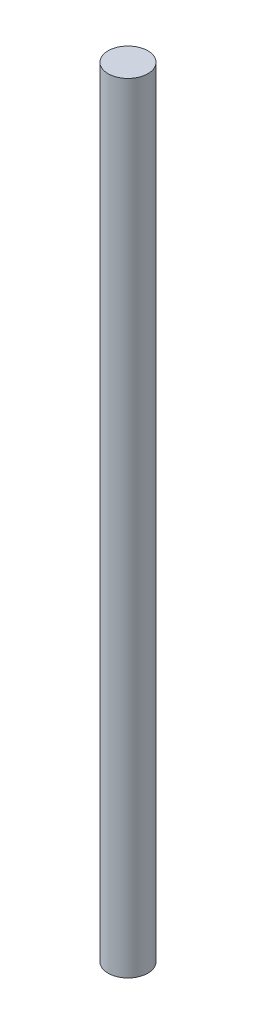
ISO-10303-21;
HEADER;
FILE_DESCRIPTION(('STEP AP214'),'2;1');
FILE_NAME('part.step','',(''),(''),'','','');
FILE_SCHEMA(('AUTOMOTIVE_DESIGN { 1 0 10303 214 1 1 1 1 }'));
ENDSEC;
DATA;
#1=APPLICATION_CONTEXT('core data for automotive mechanical design processes');
#2=APPLICATION_PROTOCOL_DEFINITION('international standard','automotive_design',2000,#1);
#3=PRODUCT_CONTEXT('',#1,'mechanical');
#4=PRODUCT('Part','Part','',(#3));
#5=PRODUCT_RELATED_PRODUCT_CATEGORY('part','',(#4));
#6=PRODUCT_DEFINITION_FORMATION('','',#4);
#7=PRODUCT_DEFINITION_CONTEXT('part definition',#1,'design');
#8=PRODUCT_DEFINITION('design','',#6,#7);
#9=PRODUCT_DEFINITION_SHAPE('','',#8);
#10=(LENGTH_UNIT() NAMED_UNIT(*) SI_UNIT(.MILLI.,.METRE.));
#11=(NAMED_UNIT(*) PLANE_ANGLE_UNIT() SI_UNIT($,.RADIAN.));
#12=(NAMED_UNIT(*) SI_UNIT($,.STERADIAN.) SOLID_ANGLE_UNIT());
#13=UNCERTAINTY_MEASURE_WITH_UNIT(LENGTH_MEASURE(1.E-05),#10,'distance_accuracy_value','');
#14=(GEOMETRIC_REPRESENTATION_CONTEXT(3) GLOBAL_UNCERTAINTY_ASSIGNED_CONTEXT((#13)) GLOBAL_UNIT_ASSIGNED_CONTEXT((#10,
#11,#12)) REPRESENTATION_CONTEXT('',''));
#15=CARTESIAN_POINT('',(0.,0.,0.));
#16=DIRECTION('',(0.,0.,1.));
#17=DIRECTION('',(1.,0.,0.));
#18=AXIS2_PLACEMENT_3D('',#15,#16,#17);
#19=CARTESIAN_POINT('',(0.,-70.,0.));
#20=DIRECTION('',(0.,1.,0.));
#21=DIRECTION('',(0.,0.,1.));
#22=AXIS2_PLACEMENT_3D('',#19,#20,#21);
#23=CYLINDRICAL_SURFACE('',#22,2.5);
#24=CARTESIAN_POINT('',(0.,-70.,0.));
#25=DIRECTION('',(0.,1.,0.));
#26=DIRECTION('',(0.,0.,1.));
#27=AXIS2_PLACEMENT_3D('',#24,#25,#26);
#28=CIRCLE('',#27,2.5);
#29=CARTESIAN_POINT('',(0.,-70.,2.5));
#30=VERTEX_POINT('',#29);
#31=EDGE_CURVE('E10',#30,#30,#28,.T.);
#32=ORIENTED_EDGE('',*,*,#31,.T.);
#33=EDGE_LOOP('',(#32));
#34=FACE_BOUND('',#33,.T.);
#35=CARTESIAN_POINT('',(0.,28.,0.));
#36=DIRECTION('',(0.,1.,0.));
#37=DIRECTION('',(0.,0.,1.));
#38=AXIS2_PLACEMENT_3D('',#35,#36,#37);
#39=CIRCLE('',#38,2.5);
#40=CARTESIAN_POINT('',(0.,28.,2.5));
#41=VERTEX_POINT('',#40);
#42=EDGE_CURVE('E36',#41,#41,#39,.T.);
#43=ORIENTED_EDGE('',*,*,#42,.F.);
#44=EDGE_LOOP('',(#43));
#45=FACE_BOUND('',#44,.T.);
#46=ADVANCED_FACE('F30',(#34,#45),#23,.T.);
#47=CARTESIAN_POINT('',(0.,-70.,0.));
#48=DIRECTION('',(0.,1.,0.));
#49=DIRECTION('',(0.,0.,1.));
#50=AXIS2_PLACEMENT_3D('',#47,#48,#49);
#51=PLANE('',#50);
#52=ORIENTED_EDGE('',*,*,#31,.F.);
#53=EDGE_LOOP('',(#52));
#54=FACE_BOUND('',#53,.T.);
#55=ADVANCED_FACE('F45',(#54),#51,.F.);
#56=CARTESIAN_POINT('',(0.,28.,0.));
#57=DIRECTION('',(0.,1.,0.));
#58=DIRECTION('',(0.,0.,1.));
#59=AXIS2_PLACEMENT_3D('',#56,#57,#58);
#60=PLANE('',#59);
#61=ORIENTED_EDGE('',*,*,#42,.T.);
#62=EDGE_LOOP('',(#61));
#63=FACE_BOUND('',#62,.T.);
#64=ADVANCED_FACE('F42',(#63),#60,.T.);
#65=CLOSED_SHELL('',(#46,#55,#64));
#66=MANIFOLD_SOLID_BREP('B2',#65);
#67=ADVANCED_BREP_SHAPE_REPRESENTATION('',(#18,#66),#14);
#68=SHAPE_DEFINITION_REPRESENTATION(#9,#67);
ENDSEC;
END-ISO-10303-21;
